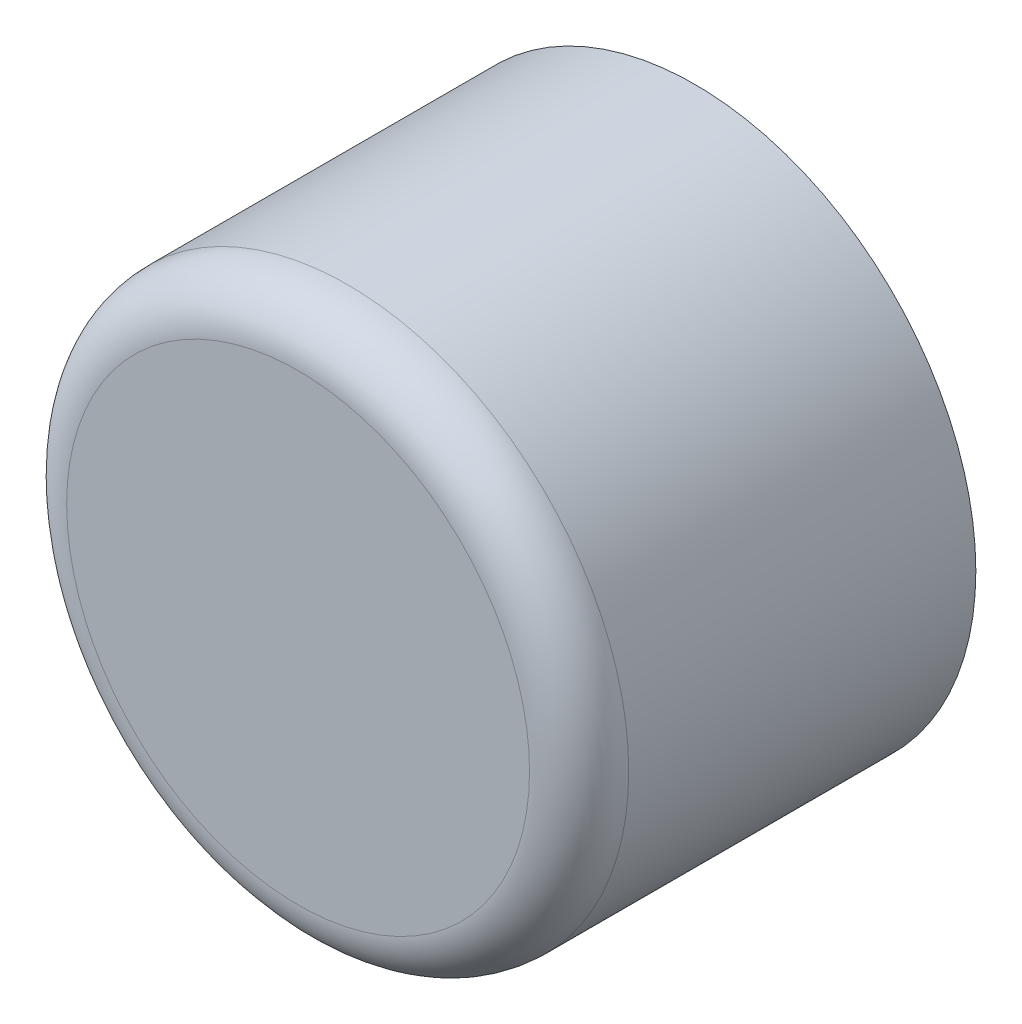
ISO-10303-21;
HEADER;
FILE_DESCRIPTION(('STEP AP214'),'2;1');
FILE_NAME('part.step','',(''),(''),'','','');
FILE_SCHEMA(('AUTOMOTIVE_DESIGN { 1 0 10303 214 1 1 1 1 }'));
ENDSEC;
DATA;
#1=APPLICATION_CONTEXT('core data for automotive mechanical design processes');
#2=APPLICATION_PROTOCOL_DEFINITION('international standard','automotive_design',2000,#1);
#3=PRODUCT_CONTEXT('',#1,'mechanical');
#4=PRODUCT('Part','Part','',(#3));
#5=PRODUCT_RELATED_PRODUCT_CATEGORY('part','',(#4));
#6=PRODUCT_DEFINITION_FORMATION('','',#4);
#7=PRODUCT_DEFINITION_CONTEXT('part definition',#1,'design');
#8=PRODUCT_DEFINITION('design','',#6,#7);
#9=PRODUCT_DEFINITION_SHAPE('','',#8);
#10=(LENGTH_UNIT() NAMED_UNIT(*) SI_UNIT(.MILLI.,.METRE.));
#11=(NAMED_UNIT(*) PLANE_ANGLE_UNIT() SI_UNIT($,.RADIAN.));
#12=(NAMED_UNIT(*) SI_UNIT($,.STERADIAN.) SOLID_ANGLE_UNIT());
#13=UNCERTAINTY_MEASURE_WITH_UNIT(LENGTH_MEASURE(1.E-05),#10,'distance_accuracy_value','');
#14=(GEOMETRIC_REPRESENTATION_CONTEXT(3) GLOBAL_UNCERTAINTY_ASSIGNED_CONTEXT((#13)) GLOBAL_UNIT_ASSIGNED_CONTEXT((#10,
#11,#12)) REPRESENTATION_CONTEXT('',''));
#15=CARTESIAN_POINT('',(0.,0.,0.));
#16=DIRECTION('',(0.,0.,1.));
#17=DIRECTION('',(1.,0.,0.));
#18=AXIS2_PLACEMENT_3D('',#15,#16,#17);
#19=CARTESIAN_POINT('',(0.,0.,10.5));
#20=DIRECTION('',(0.,0.,1.));
#21=DIRECTION('',(1.,0.,0.));
#22=AXIS2_PLACEMENT_3D('',#19,#20,#21);
#23=TOROIDAL_SURFACE('',#22,7.,1.5);
#24=CARTESIAN_POINT('',(0.,0.,12.));
#25=DIRECTION('',(0.,0.,1.));
#26=DIRECTION('',(1.,0.,0.));
#27=AXIS2_PLACEMENT_3D('',#24,#25,#26);
#28=CIRCLE('',#27,7.);
#29=CARTESIAN_POINT('',(7.,0.,12.));
#30=VERTEX_POINT('',#29);
#31=EDGE_CURVE('E48',#30,#30,#28,.T.);
#32=ORIENTED_EDGE('',*,*,#31,.F.);
#33=EDGE_LOOP('',(#32));
#34=FACE_BOUND('',#33,.T.);
#35=CARTESIAN_POINT('',(0.,0.,10.5));
#36=DIRECTION('',(0.,0.,1.));
#37=DIRECTION('',(1.,0.,0.));
#38=AXIS2_PLACEMENT_3D('',#35,#36,#37);
#39=CIRCLE('',#38,8.5);
#40=CARTESIAN_POINT('',(8.5,0.,10.5));
#41=VERTEX_POINT('',#40);
#42=EDGE_CURVE('E10',#41,#41,#39,.F.);
#43=ORIENTED_EDGE('',*,*,#42,.F.);
#44=EDGE_LOOP('',(#43));
#45=FACE_BOUND('',#44,.T.);
#46=ADVANCED_FACE('F41',(#34,#45),#23,.T.);
#47=CARTESIAN_POINT('',(0.,0.,12.));
#48=DIRECTION('',(0.,0.,-1.));
#49=DIRECTION('',(-1.,0.,0.));
#50=AXIS2_PLACEMENT_3D('',#47,#48,#49);
#51=CYLINDRICAL_SURFACE('',#50,8.5);
#52=ORIENTED_EDGE('',*,*,#42,.T.);
#53=EDGE_LOOP('',(#52));
#54=FACE_BOUND('',#53,.T.);
#55=CARTESIAN_POINT('',(0.,0.,0.));
#56=DIRECTION('',(0.,0.,1.));
#57=DIRECTION('',(1.,0.,0.));
#58=AXIS2_PLACEMENT_3D('',#55,#56,#57);
#59=CIRCLE('',#58,8.5);
#60=CARTESIAN_POINT('',(8.5,0.,0.));
#61=VERTEX_POINT('',#60);
#62=EDGE_CURVE('E53',#61,#61,#59,.T.);
#63=ORIENTED_EDGE('',*,*,#62,.T.);
#64=EDGE_LOOP('',(#63));
#65=FACE_BOUND('',#64,.T.);
#66=ADVANCED_FACE('F61',(#54,#65),#51,.T.);
#67=CARTESIAN_POINT('',(0.,0.,12.));
#68=DIRECTION('',(0.,0.,1.));
#69=DIRECTION('',(1.,0.,0.));
#70=AXIS2_PLACEMENT_3D('',#67,#68,#69);
#71=PLANE('',#70);
#72=ORIENTED_EDGE('',*,*,#31,.T.);
#73=EDGE_LOOP('',(#72));
#74=FACE_BOUND('',#73,.T.);
#75=ADVANCED_FACE('F65',(#74),#71,.T.);
#76=CARTESIAN_POINT('',(0.,0.,0.));
#77=DIRECTION('',(0.,0.,1.));
#78=DIRECTION('',(1.,0.,0.));
#79=AXIS2_PLACEMENT_3D('',#76,#77,#78);
#80=PLANE('',#79);
#81=ORIENTED_EDGE('',*,*,#62,.F.);
#82=EDGE_LOOP('',(#81));
#83=FACE_BOUND('',#82,.T.);
#84=ADVANCED_FACE('F63',(#83),#80,.F.);
#85=CLOSED_SHELL('',(#46,#66,#75,#84));
#86=MANIFOLD_SOLID_BREP('B2',#85);
#87=ADVANCED_BREP_SHAPE_REPRESENTATION('',(#18,#86),#14);
#88=SHAPE_DEFINITION_REPRESENTATION(#9,#87);
ENDSEC;
END-ISO-10303-21;
